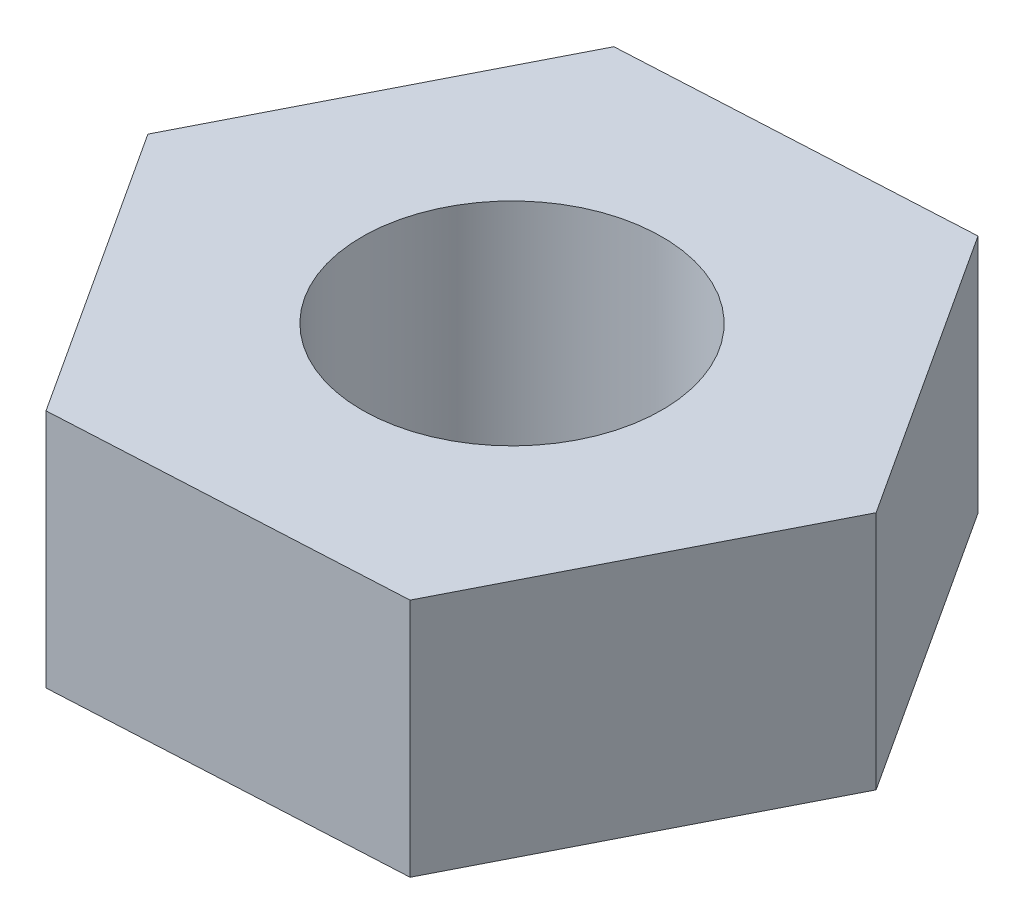
ISO-10303-21;
HEADER;
FILE_DESCRIPTION(('STEP AP214'),'2;1');
FILE_NAME('part.step','',(''),(''),'','','');
FILE_SCHEMA(('AUTOMOTIVE_DESIGN { 1 0 10303 214 1 1 1 1 }'));
ENDSEC;
DATA;
#1=APPLICATION_CONTEXT('core data for automotive mechanical design processes');
#2=APPLICATION_PROTOCOL_DEFINITION('international standard','automotive_design',2000,#1);
#3=PRODUCT_CONTEXT('',#1,'mechanical');
#4=PRODUCT('Part','Part','',(#3));
#5=PRODUCT_RELATED_PRODUCT_CATEGORY('part','',(#4));
#6=PRODUCT_DEFINITION_FORMATION('','',#4);
#7=PRODUCT_DEFINITION_CONTEXT('part definition',#1,'design');
#8=PRODUCT_DEFINITION('design','',#6,#7);
#9=PRODUCT_DEFINITION_SHAPE('','',#8);
#10=(LENGTH_UNIT() NAMED_UNIT(*) SI_UNIT(.MILLI.,.METRE.));
#11=(NAMED_UNIT(*) PLANE_ANGLE_UNIT() SI_UNIT($,.RADIAN.));
#12=(NAMED_UNIT(*) SI_UNIT($,.STERADIAN.) SOLID_ANGLE_UNIT());
#13=UNCERTAINTY_MEASURE_WITH_UNIT(LENGTH_MEASURE(1.E-05),#10,'distance_accuracy_value','');
#14=(GEOMETRIC_REPRESENTATION_CONTEXT(3) GLOBAL_UNCERTAINTY_ASSIGNED_CONTEXT((#13)) GLOBAL_UNIT_ASSIGNED_CONTEXT((#10,
#11,#12)) REPRESENTATION_CONTEXT('',''));
#15=CARTESIAN_POINT('',(0.,0.,0.));
#16=DIRECTION('',(0.,0.,1.));
#17=DIRECTION('',(1.,0.,0.));
#18=AXIS2_PLACEMENT_3D('',#15,#16,#17);
#19=CARTESIAN_POINT('',(0.,1.6,0.));
#20=DIRECTION('',(0.,1.,0.));
#21=DIRECTION('',(0.,0.,1.));
#22=AXIS2_PLACEMENT_3D('',#19,#20,#21);
#23=PLANE('',#22);
#24=DIRECTION('',(0.998631630193834,0.,-0.0522959575531863));
#25=VECTOR('',#24,1.);
#26=CARTESIAN_POINT('',(-1.048528565921,1.6,2.05764943072939));
#27=LINE('',#26,#25);
#28=CARTESIAN_POINT('',(-1.048528565921,1.6,2.05764943072939));
#29=VERTEX_POINT('',#28);
#30=CARTESIAN_POINT('',(1.25771239613374,1.6,1.93687709004595));
#31=VERTEX_POINT('',#30);
#32=EDGE_CURVE('E146',#29,#31,#27,.T.);
#33=ORIENTED_EDGE('',*,*,#32,.T.);
#34=DIRECTION('',(0.454026187340625,0.,-0.890988339547121));
#35=VECTOR('',#34,1.);
#36=CARTESIAN_POINT('',(1.25771239613374,1.6,1.93687709004595));
#37=LINE('',#36,#35);
#38=CARTESIAN_POINT('',(2.30624096205474,1.6,-0.120772340683445));
#39=VERTEX_POINT('',#38);
#40=EDGE_CURVE('E94',#31,#39,#37,.T.);
#41=ORIENTED_EDGE('',*,*,#40,.T.);
#42=DIRECTION('',(-0.544605442853209,0.,-0.838692381993935));
#43=VECTOR('',#42,1.);
#44=CARTESIAN_POINT('',(2.30624096205474,1.6,-0.120772340683445));
#45=LINE('',#44,#43);
#46=CARTESIAN_POINT('',(1.048528565921,1.6,-2.05764943072939));
#47=VERTEX_POINT('',#46);
#48=EDGE_CURVE('E107',#39,#47,#45,.T.);
#49=ORIENTED_EDGE('',*,*,#48,.T.);
#50=DIRECTION('',(-0.998631630193834,0.,0.0522959575531865));
#51=VECTOR('',#50,1.);
#52=CARTESIAN_POINT('',(1.048528565921,1.6,-2.05764943072939));
#53=LINE('',#52,#51);
#54=CARTESIAN_POINT('',(-1.25771239613374,1.6,-1.93687709004595));
#55=VERTEX_POINT('',#54);
#56=EDGE_CURVE('E101',#47,#55,#53,.T.);
#57=ORIENTED_EDGE('',*,*,#56,.T.);
#58=DIRECTION('',(-0.454026187340625,0.,0.890988339547121));
#59=VECTOR('',#58,1.);
#60=CARTESIAN_POINT('',(-1.25771239613374,1.6,-1.93687709004595));
#61=LINE('',#60,#59);
#62=CARTESIAN_POINT('',(-2.30624096205474,1.6,0.120772340683445));
#63=VERTEX_POINT('',#62);
#64=EDGE_CURVE('E105',#55,#63,#61,.T.);
#65=ORIENTED_EDGE('',*,*,#64,.T.);
#66=DIRECTION('',(0.544605442853209,0.,0.838692381993935));
#67=VECTOR('',#66,1.);
#68=CARTESIAN_POINT('',(-2.30624096205474,1.6,0.120772340683445));
#69=LINE('',#68,#67);
#70=EDGE_CURVE('E57',#63,#29,#69,.T.);
#71=ORIENTED_EDGE('',*,*,#70,.T.);
#72=EDGE_LOOP('',(#33,#41,#49,#57,#65,#71));
#73=FACE_BOUND('',#72,.T.);
#74=CARTESIAN_POINT('',(0.,1.6,0.));
#75=DIRECTION('',(0.,1.,0.));
#76=DIRECTION('',(0.,0.,1.));
#77=AXIS2_PLACEMENT_3D('',#74,#75,#76);
#78=CIRCLE('',#77,1.);
#79=CARTESIAN_POINT('',(0.,1.6,1.));
#80=VERTEX_POINT('',#79);
#81=EDGE_CURVE('E134',#80,#80,#78,.T.);
#82=ORIENTED_EDGE('',*,*,#81,.F.);
#83=EDGE_LOOP('',(#82));
#84=FACE_BOUND('',#83,.T.);
#85=ADVANCED_FACE('F39',(#73,#84),#23,.T.);
#86=CARTESIAN_POINT('',(0.,0.,0.));
#87=DIRECTION('',(0.,1.,0.));
#88=DIRECTION('',(0.,0.,1.));
#89=AXIS2_PLACEMENT_3D('',#86,#87,#88);
#90=PLANE('',#89);
#91=DIRECTION('',(0.998631630193834,0.,-0.0522959575531863));
#92=VECTOR('',#91,1.);
#93=CARTESIAN_POINT('',(-1.048528565921,0.,2.05764943072939));
#94=LINE('',#93,#92);
#95=CARTESIAN_POINT('',(-1.048528565921,0.,2.05764943072939));
#96=VERTEX_POINT('',#95);
#97=CARTESIAN_POINT('',(1.25771239613374,0.,1.93687709004595));
#98=VERTEX_POINT('',#97);
#99=EDGE_CURVE('E129',#96,#98,#94,.T.);
#100=ORIENTED_EDGE('',*,*,#99,.F.);
#101=DIRECTION('',(0.544605442853209,0.,0.838692381993935));
#102=VECTOR('',#101,1.);
#103=CARTESIAN_POINT('',(-2.30624096205474,0.,0.120772340683445));
#104=LINE('',#103,#102);
#105=CARTESIAN_POINT('',(-2.30624096205474,0.,0.120772340683445));
#106=VERTEX_POINT('',#105);
#107=EDGE_CURVE('E86',#106,#96,#104,.T.);
#108=ORIENTED_EDGE('',*,*,#107,.F.);
#109=DIRECTION('',(-0.454026187340625,0.,0.890988339547121));
#110=VECTOR('',#109,1.);
#111=CARTESIAN_POINT('',(-1.25771239613374,0.,-1.93687709004595));
#112=LINE('',#111,#110);
#113=CARTESIAN_POINT('',(-1.25771239613374,0.,-1.93687709004595));
#114=VERTEX_POINT('',#113);
#115=EDGE_CURVE('E80',#114,#106,#112,.T.);
#116=ORIENTED_EDGE('',*,*,#115,.F.);
#117=DIRECTION('',(-0.998631630193834,0.,0.0522959575531865));
#118=VECTOR('',#117,1.);
#119=CARTESIAN_POINT('',(1.048528565921,0.,-2.05764943072939));
#120=LINE('',#119,#118);
#121=CARTESIAN_POINT('',(1.048528565921,0.,-2.05764943072939));
#122=VERTEX_POINT('',#121);
#123=EDGE_CURVE('E116',#122,#114,#120,.T.);
#124=ORIENTED_EDGE('',*,*,#123,.F.);
#125=DIRECTION('',(-0.544605442853209,0.,-0.838692381993935));
#126=VECTOR('',#125,1.);
#127=CARTESIAN_POINT('',(2.30624096205474,0.,-0.120772340683445));
#128=LINE('',#127,#126);
#129=CARTESIAN_POINT('',(2.30624096205474,0.,-0.120772340683445));
#130=VERTEX_POINT('',#129);
#131=EDGE_CURVE('E137',#130,#122,#128,.T.);
#132=ORIENTED_EDGE('',*,*,#131,.F.);
#133=DIRECTION('',(0.454026187340625,0.,-0.890988339547121));
#134=VECTOR('',#133,1.);
#135=CARTESIAN_POINT('',(1.25771239613374,0.,1.93687709004595));
#136=LINE('',#135,#134);
#137=EDGE_CURVE('E133',#98,#130,#136,.T.);
#138=ORIENTED_EDGE('',*,*,#137,.F.);
#139=EDGE_LOOP('',(#100,#108,#116,#124,#132,#138));
#140=FACE_BOUND('',#139,.T.);
#141=CARTESIAN_POINT('',(0.,0.,0.));
#142=DIRECTION('',(0.,1.,0.));
#143=DIRECTION('',(0.,0.,1.));
#144=AXIS2_PLACEMENT_3D('',#141,#142,#143);
#145=CIRCLE('',#144,1.);
#146=CARTESIAN_POINT('',(0.,0.,1.));
#147=VERTEX_POINT('',#146);
#148=EDGE_CURVE('E243',#147,#147,#145,.T.);
#149=ORIENTED_EDGE('',*,*,#148,.T.);
#150=EDGE_LOOP('',(#149));
#151=FACE_BOUND('',#150,.T.);
#152=ADVANCED_FACE('F159',(#140,#151),#90,.F.);
#153=CARTESIAN_POINT('',(-1.048528565921,1.6,2.05764943072939));
#154=DIRECTION('',(-0.0522959575531863,0.,-0.998631630193834));
#155=DIRECTION('',(-0.998631630193834,0.,0.0522959575531863));
#156=AXIS2_PLACEMENT_3D('',#153,#154,#155);
#157=PLANE('',#156);
#158=ORIENTED_EDGE('',*,*,#99,.T.);
#159=DIRECTION('',(0.,-1.,0.));
#160=VECTOR('',#159,1.);
#161=CARTESIAN_POINT('',(1.25771239613374,1.6,1.93687709004595));
#162=LINE('',#161,#160);
#163=EDGE_CURVE('E11',#31,#98,#162,.T.);
#164=ORIENTED_EDGE('',*,*,#163,.F.);
#165=ORIENTED_EDGE('',*,*,#32,.F.);
#166=DIRECTION('',(0.,-1.,0.));
#167=VECTOR('',#166,1.);
#168=CARTESIAN_POINT('',(-1.048528565921,1.6,2.05764943072939));
#169=LINE('',#168,#167);
#170=EDGE_CURVE('E125',#29,#96,#169,.T.);
#171=ORIENTED_EDGE('',*,*,#170,.T.);
#172=EDGE_LOOP('',(#158,#164,#165,#171));
#173=FACE_BOUND('',#172,.T.);
#174=ADVANCED_FACE('F41',(#173),#157,.F.);
#175=CARTESIAN_POINT('',(1.25771239613374,1.6,1.93687709004595));
#176=DIRECTION('',(-0.890988339547121,0.,-0.454026187340625));
#177=DIRECTION('',(-0.454026187340625,0.,0.890988339547121));
#178=AXIS2_PLACEMENT_3D('',#175,#176,#177);
#179=PLANE('',#178);
#180=ORIENTED_EDGE('',*,*,#137,.T.);
#181=DIRECTION('',(0.,-1.,0.));
#182=VECTOR('',#181,1.);
#183=CARTESIAN_POINT('',(2.30624096205474,1.6,-0.120772340683445));
#184=LINE('',#183,#182);
#185=EDGE_CURVE('E49',#39,#130,#184,.T.);
#186=ORIENTED_EDGE('',*,*,#185,.F.);
#187=ORIENTED_EDGE('',*,*,#40,.F.);
#188=ORIENTED_EDGE('',*,*,#163,.T.);
#189=EDGE_LOOP('',(#180,#186,#187,#188));
#190=FACE_BOUND('',#189,.T.);
#191=ADVANCED_FACE('F184',(#190),#179,.F.);
#192=CARTESIAN_POINT('',(2.30624096205474,1.6,-0.120772340683445));
#193=DIRECTION('',(-0.838692381993935,0.,0.544605442853209));
#194=DIRECTION('',(0.544605442853209,0.,0.838692381993935));
#195=AXIS2_PLACEMENT_3D('',#192,#193,#194);
#196=PLANE('',#195);
#197=ORIENTED_EDGE('',*,*,#131,.T.);
#198=DIRECTION('',(0.,-1.,0.));
#199=VECTOR('',#198,1.);
#200=CARTESIAN_POINT('',(1.048528565921,1.6,-2.05764943072939));
#201=LINE('',#200,#199);
#202=EDGE_CURVE('E118',#47,#122,#201,.T.);
#203=ORIENTED_EDGE('',*,*,#202,.F.);
#204=ORIENTED_EDGE('',*,*,#48,.F.);
#205=ORIENTED_EDGE('',*,*,#185,.T.);
#206=EDGE_LOOP('',(#197,#203,#204,#205));
#207=FACE_BOUND('',#206,.T.);
#208=ADVANCED_FACE('F156',(#207),#196,.F.);
#209=CARTESIAN_POINT('',(1.048528565921,1.6,-2.05764943072939));
#210=DIRECTION('',(0.0522959575531865,0.,0.998631630193834));
#211=DIRECTION('',(0.998631630193834,0.,-0.0522959575531865));
#212=AXIS2_PLACEMENT_3D('',#209,#210,#211);
#213=PLANE('',#212);
#214=ORIENTED_EDGE('',*,*,#123,.T.);
#215=DIRECTION('',(0.,-1.,0.));
#216=VECTOR('',#215,1.);
#217=CARTESIAN_POINT('',(-1.25771239613374,1.6,-1.93687709004595));
#218=LINE('',#217,#216);
#219=EDGE_CURVE('E113',#55,#114,#218,.T.);
#220=ORIENTED_EDGE('',*,*,#219,.F.);
#221=ORIENTED_EDGE('',*,*,#56,.F.);
#222=ORIENTED_EDGE('',*,*,#202,.T.);
#223=EDGE_LOOP('',(#214,#220,#221,#222));
#224=FACE_BOUND('',#223,.T.);
#225=ADVANCED_FACE('F114',(#224),#213,.F.);
#226=CARTESIAN_POINT('',(-1.25771239613374,1.6,-1.93687709004595));
#227=DIRECTION('',(0.890988339547121,0.,0.454026187340625));
#228=DIRECTION('',(0.454026187340625,0.,-0.890988339547121));
#229=AXIS2_PLACEMENT_3D('',#226,#227,#228);
#230=PLANE('',#229);
#231=ORIENTED_EDGE('',*,*,#115,.T.);
#232=DIRECTION('',(0.,-1.,0.));
#233=VECTOR('',#232,1.);
#234=CARTESIAN_POINT('',(-2.30624096205474,1.6,0.120772340683445));
#235=LINE('',#234,#233);
#236=EDGE_CURVE('E119',#63,#106,#235,.T.);
#237=ORIENTED_EDGE('',*,*,#236,.F.);
#238=ORIENTED_EDGE('',*,*,#64,.F.);
#239=ORIENTED_EDGE('',*,*,#219,.T.);
#240=EDGE_LOOP('',(#231,#237,#238,#239));
#241=FACE_BOUND('',#240,.T.);
#242=ADVANCED_FACE('F121',(#241),#230,.F.);
#243=CARTESIAN_POINT('',(-2.30624096205474,1.6,0.120772340683445));
#244=DIRECTION('',(0.838692381993935,0.,-0.544605442853209));
#245=DIRECTION('',(-0.544605442853209,0.,-0.838692381993935));
#246=AXIS2_PLACEMENT_3D('',#243,#244,#245);
#247=PLANE('',#246);
#248=ORIENTED_EDGE('',*,*,#107,.T.);
#249=ORIENTED_EDGE('',*,*,#170,.F.);
#250=ORIENTED_EDGE('',*,*,#70,.F.);
#251=ORIENTED_EDGE('',*,*,#236,.T.);
#252=EDGE_LOOP('',(#248,#249,#250,#251));
#253=FACE_BOUND('',#252,.T.);
#254=ADVANCED_FACE('F164',(#253),#247,.F.);
#255=CARTESIAN_POINT('',(0.,1.6,0.));
#256=DIRECTION('',(0.,-1.,0.));
#257=DIRECTION('',(0.,0.,-1.));
#258=AXIS2_PLACEMENT_3D('',#255,#256,#257);
#259=CYLINDRICAL_SURFACE('',#258,1.);
#260=ORIENTED_EDGE('',*,*,#81,.T.);
#261=EDGE_LOOP('',(#260));
#262=FACE_BOUND('',#261,.T.);
#263=ORIENTED_EDGE('',*,*,#148,.F.);
#264=EDGE_LOOP('',(#263));
#265=FACE_BOUND('',#264,.T.);
#266=ADVANCED_FACE('F166',(#262,#265),#259,.F.);
#267=CLOSED_SHELL('',(#85,#152,#174,#191,#208,#225,#242,#254,#266));
#268=MANIFOLD_SOLID_BREP('B2',#267);
#269=ADVANCED_BREP_SHAPE_REPRESENTATION('',(#18,#268),#14);
#270=SHAPE_DEFINITION_REPRESENTATION(#9,#269);
ENDSEC;
END-ISO-10303-21;
